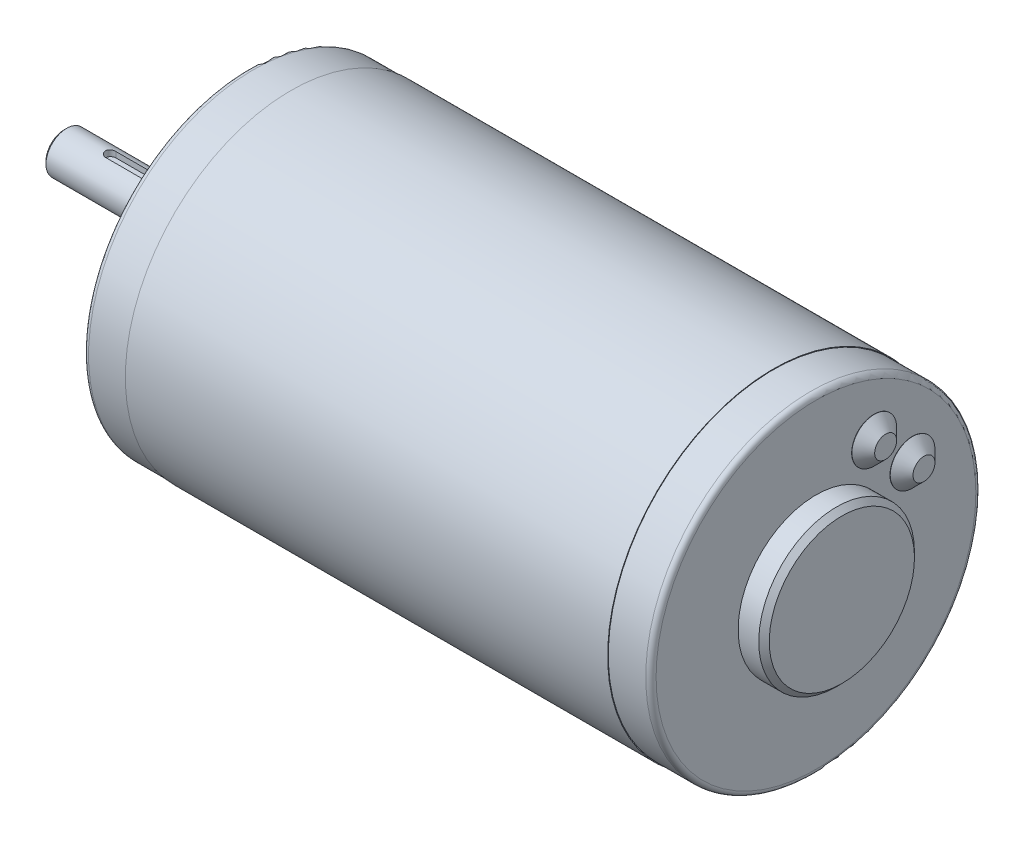
ISO-10303-21;
HEADER;
FILE_DESCRIPTION(('STEP AP214'),'2;1');
FILE_NAME('part.step','',(''),(''),'','','');
FILE_SCHEMA(('AUTOMOTIVE_DESIGN { 1 0 10303 214 1 1 1 1 }'));
ENDSEC;
DATA;
#1=APPLICATION_CONTEXT('core data for automotive mechanical design processes');
#2=APPLICATION_PROTOCOL_DEFINITION('international standard','automotive_design',2000,#1);
#3=PRODUCT_CONTEXT('',#1,'mechanical');
#4=PRODUCT('Part','Part','',(#3));
#5=PRODUCT_RELATED_PRODUCT_CATEGORY('part','',(#4));
#6=PRODUCT_DEFINITION_FORMATION('','',#4);
#7=PRODUCT_DEFINITION_CONTEXT('part definition',#1,'design');
#8=PRODUCT_DEFINITION('design','',#6,#7);
#9=PRODUCT_DEFINITION_SHAPE('','',#8);
#10=(LENGTH_UNIT() NAMED_UNIT(*) SI_UNIT(.MILLI.,.METRE.));
#11=(NAMED_UNIT(*) PLANE_ANGLE_UNIT() SI_UNIT($,.RADIAN.));
#12=(NAMED_UNIT(*) SI_UNIT($,.STERADIAN.) SOLID_ANGLE_UNIT());
#13=UNCERTAINTY_MEASURE_WITH_UNIT(LENGTH_MEASURE(1.E-05),#10,'distance_accuracy_value','');
#14=(GEOMETRIC_REPRESENTATION_CONTEXT(3) GLOBAL_UNCERTAINTY_ASSIGNED_CONTEXT((#13)) GLOBAL_UNIT_ASSIGNED_CONTEXT((#10,
#11,#12)) REPRESENTATION_CONTEXT('',''));
#15=CARTESIAN_POINT('',(0.,0.,0.));
#16=DIRECTION('',(0.,0.,1.));
#17=DIRECTION('',(1.,0.,0.));
#18=AXIS2_PLACEMENT_3D('',#15,#16,#17);
#19=CARTESIAN_POINT('',(-27.6,2.79999999999999,-1.));
#20=DIRECTION('',(0.,-1.,0.));
#21=DIRECTION('',(0.,0.,-1.));
#22=AXIS2_PLACEMENT_3D('',#19,#20,#21);
#23=PLANE('',#22);
#24=CARTESIAN_POINT('',(-7.1,2.79999999999999,0.));
#25=DIRECTION('',(0.,1.,0.));
#26=DIRECTION('',(0.,0.,1.));
#27=AXIS2_PLACEMENT_3D('',#24,#25,#26);
#28=CIRCLE('',#27,1.);
#29=CARTESIAN_POINT('',(-7.1,2.79999999999999,1.));
#30=VERTEX_POINT('',#29);
#31=CARTESIAN_POINT('',(-7.1,2.79999999999999,-1.));
#32=VERTEX_POINT('',#31);
#33=EDGE_CURVE('E79',#30,#32,#28,.T.);
#34=ORIENTED_EDGE('',*,*,#33,.T.);
#35=DIRECTION('',(1.,0.,0.));
#36=VECTOR('',#35,1.);
#37=CARTESIAN_POINT('',(-27.6,2.79999999999999,-1.));
#38=LINE('',#37,#36);
#39=CARTESIAN_POINT('',(-26.6,2.79999999999999,-1.));
#40=VERTEX_POINT('',#39);
#41=EDGE_CURVE('E74',#40,#32,#38,.T.);
#42=ORIENTED_EDGE('',*,*,#41,.F.);
#43=CARTESIAN_POINT('',(-26.6,2.79999999999999,0.));
#44=DIRECTION('',(0.,-1.,0.));
#45=DIRECTION('',(0.,0.,-1.));
#46=AXIS2_PLACEMENT_3D('',#43,#44,#45);
#47=CIRCLE('',#46,1.);
#48=CARTESIAN_POINT('',(-26.6,2.79999999999999,1.));
#49=VERTEX_POINT('',#48);
#50=EDGE_CURVE('E76',#40,#49,#47,.F.);
#51=ORIENTED_EDGE('',*,*,#50,.T.);
#52=DIRECTION('',(1.,0.,0.));
#53=VECTOR('',#52,1.);
#54=CARTESIAN_POINT('',(-27.6,2.79999999999999,1.));
#55=LINE('',#54,#53);
#56=EDGE_CURVE('E102',#49,#30,#55,.T.);
#57=ORIENTED_EDGE('',*,*,#56,.T.);
#58=EDGE_LOOP('',(#34,#42,#51,#57));
#59=FACE_BOUND('',#58,.T.);
#60=ADVANCED_FACE('F16',(#59),#23,.F.);
#61=CARTESIAN_POINT('',(-35.6,0.,0.));
#62=DIRECTION('',(-1.,0.,0.));
#63=DIRECTION('',(0.,0.,1.));
#64=AXIS2_PLACEMENT_3D('',#61,#62,#63);
#65=PLANE('',#64);
#66=CARTESIAN_POINT('',(-35.6000000000449,0.,0.));
#67=DIRECTION('',(1.,0.,0.));
#68=DIRECTION('',(0.,0.,-1.));
#69=AXIS2_PLACEMENT_3D('',#66,#67,#68);
#70=CIRCLE('',#69,3.49999999997408);
#71=CARTESIAN_POINT('',(-35.6000000000449,0.,-3.49999999997408));
#72=VERTEX_POINT('',#71);
#73=EDGE_CURVE('E324',#72,#72,#70,.T.);
#74=ORIENTED_EDGE('',*,*,#73,.F.);
#75=EDGE_LOOP('',(#74));
#76=FACE_BOUND('',#75,.T.);
#77=ADVANCED_FACE('F663',(#76),#65,.T.);
#78=CARTESIAN_POINT('',(-26.6,3.87298334620741,0.));
#79=DIRECTION('',(0.,-1.,0.));
#80=DIRECTION('',(0.,0.,-1.));
#81=AXIS2_PLACEMENT_3D('',#78,#79,#80);
#82=CYLINDRICAL_SURFACE('',#81,1.);
#83=CARTESIAN_POINT('',(-26.6,3.87298334620741,1.));
#84=CARTESIAN_POINT('',(-26.6276629851065,3.87298148580177,1.00000033749611));
#85=CARTESIAN_POINT('',(-26.6553122630182,3.8732800994947,0.998851407375366));
#86=CARTESIAN_POINT('',(-26.7104040353036,3.87445904774558,0.994271295395754));
#87=CARTESIAN_POINT('',(-26.7378465636871,3.87533928441687,0.99084049757268));
#88=CARTESIAN_POINT('',(-26.8194531732088,3.87881710972053,0.977175239382527));
#89=CARTESIAN_POINT('',(-26.8730564684822,3.88225203148808,0.963567695172493));
#90=CARTESIAN_POINT('',(-26.977124673782,3.89095422588002,0.927798076247996));
#91=CARTESIAN_POINT('',(-27.0275898782129,3.89622132630929,0.905636805423835));
#92=CARTESIAN_POINT('',(-27.1241114486473,3.90799134471939,0.853415378025865));
#93=CARTESIAN_POINT('',(-27.170166627891,3.91449459395647,0.823353103356933));
#94=CARTESIAN_POINT('',(-27.2575438819061,3.92816262398025,0.755484471828068));
#95=CARTESIAN_POINT('',(-27.2987548862455,3.93533791028915,0.717537268783974));
#96=CARTESIAN_POINT('',(-27.3743020894827,3.94945104396193,0.635275780516228));
#97=CARTESIAN_POINT('',(-27.4086371894679,3.95638885322537,0.590960479478829));
#98=CARTESIAN_POINT('',(-27.4699110016186,3.96936182283248,0.496456899401689));
#99=CARTESIAN_POINT('',(-27.496739895984,3.9753830468173,0.446195340334472));
#100=CARTESIAN_POINT('',(-27.5415247341967,3.98572346250588,0.341702590842916));
#101=CARTESIAN_POINT('',(-27.5594824242998,3.990042989147,0.287472184083007));
#102=CARTESIAN_POINT('',(-27.5856589927774,3.99641900005128,0.177744108525158));
#103=CARTESIAN_POINT('',(-27.5940676724228,3.998519529013,0.122294322002856));
#104=CARTESIAN_POINT('',(-27.6015033715433,4.00037438150815,0.0107327756816783));
#105=CARTESIAN_POINT('',(-27.6005315701923,4.00012899993444,-0.0453789000287066));
#106=CARTESIAN_POINT('',(-27.5893700363145,3.99735237365735,-0.155352492972097));
#107=CARTESIAN_POINT('',(-27.5793853834005,3.9948719867736,-0.209236701739855));
#108=CARTESIAN_POINT('',(-27.5508113208172,3.98796330636495,-0.31453871108434));
#109=CARTESIAN_POINT('',(-27.5322215304314,3.98353492665556,-0.365956402423988));
#110=CARTESIAN_POINT('',(-27.4867987193293,3.97314997761798,-0.46540728602454));
#111=CARTESIAN_POINT('',(-27.4598926057672,3.96717993827555,-0.513405629602248));
#112=CARTESIAN_POINT('',(-27.3986568701665,3.95435945541919,-0.604276631230015));
#113=CARTESIAN_POINT('',(-27.3643261297468,3.94750887933198,-0.64714851556229));
#114=CARTESIAN_POINT('',(-27.2881210879187,3.93345566022865,-0.727769389708492));
#115=CARTESIAN_POINT('',(-27.2460683634602,3.92624850477685,-0.765349103054128));
#116=CARTESIAN_POINT('',(-27.1561701330723,3.91246168284006,-0.832969575186237));
#117=CARTESIAN_POINT('',(-27.1083230467164,3.90588218842993,-0.863008270245062));
#118=CARTESIAN_POINT('',(-27.0078544021762,3.89407813586325,-0.914804709285962));
#119=CARTESIAN_POINT('',(-26.9552085351039,3.88886106009136,-0.936517017887269));
#120=CARTESIAN_POINT('',(-26.8468830715817,3.88047058807055,-0.970702351849828));
#121=CARTESIAN_POINT('',(-26.7912081448502,3.87729413761435,-0.983189189212132));
#122=CARTESIAN_POINT('',(-26.7125426192411,3.87455290681524,-0.993904635150938));
#123=CARTESIAN_POINT('',(-26.6900802967868,3.87396523110859,-0.996190790966708));
#124=CARTESIAN_POINT('',(-26.6450822100907,3.87318062488974,-0.999236757697394));
#125=CARTESIAN_POINT('',(-26.6225466240447,3.87298306219461,-0.999999038096045));
#126=CARTESIAN_POINT('',(-26.6,3.87298334620741,-1.));
#127=B_SPLINE_CURVE_WITH_KNOTS('',3,(#83,#84,#85,#86,#87,#88,#89,#90,#91,#92,#93,#94,#95,#96,
#97,#98,#99,#100,#101,#102,#103,#104,#105,#106,#107,#108,#109,#110,#111,#112,#113,#114,#115,
#116,#117,#118,#119,#120,#121,#122,#123,#124,#125,#126),.UNSPECIFIED.,.F.,.F.,(4,2,2,2,2,2,2,2,
2,2,2,2,2,2,2,2,2,2,2,2,2,4),(0.,0.0829365303397693,0.16585910608465,0.331229963080318,
0.496585282091499,0.661984974726751,0.830641897427977,0.999325753539196,1.17036187098235,
1.34136430732425,1.50890481515325,1.67642426256639,1.84022545479276,2.00403389475838,
2.16932509450376,2.33464120964329,2.50441429534542,2.67423379180967,2.84496720161068,
3.01544447539986,3.08315848722648,3.15076267731671),.UNSPECIFIED.);
#128=CARTESIAN_POINT('',(-26.6,3.87298334620741,1.));
#129=VERTEX_POINT('',#128);
#130=CARTESIAN_POINT('',(-26.6,3.87298334620741,-1.));
#131=VERTEX_POINT('',#130);
#132=EDGE_CURVE('E160',#129,#131,#127,.T.);
#133=ORIENTED_EDGE('',*,*,#132,.F.);
#134=DIRECTION('',(0.,1.,0.));
#135=VECTOR('',#134,1.);
#136=CARTESIAN_POINT('',(-26.6,2.79999999999999,1.));
#137=LINE('',#136,#135);
#138=EDGE_CURVE('E89',#129,#49,#137,.F.);
#139=ORIENTED_EDGE('',*,*,#138,.T.);
#140=ORIENTED_EDGE('',*,*,#50,.F.);
#141=DIRECTION('',(0.,1.,0.));
#142=VECTOR('',#141,1.);
#143=CARTESIAN_POINT('',(-26.6,2.79999999999999,-1.));
#144=LINE('',#143,#142);
#145=EDGE_CURVE('E83',#131,#40,#144,.F.);
#146=ORIENTED_EDGE('',*,*,#145,.F.);
#147=EDGE_LOOP('',(#133,#139,#140,#146));
#148=FACE_BOUND('',#147,.T.);
#149=ADVANCED_FACE('F86',(#148),#82,.F.);
#150=CARTESIAN_POINT('',(-27.6,2.79999999999999,-1.));
#151=DIRECTION('',(0.,0.,1.));
#152=DIRECTION('',(1.,0.,0.));
#153=AXIS2_PLACEMENT_3D('',#150,#151,#152);
#154=PLANE('',#153);
#155=DIRECTION('',(1.,0.,0.));
#156=VECTOR('',#155,1.);
#157=CARTESIAN_POINT('',(0.,3.87298334620741,-1.));
#158=LINE('',#157,#156);
#159=CARTESIAN_POINT('',(-7.1,3.87298334620741,-1.));
#160=VERTEX_POINT('',#159);
#161=EDGE_CURVE('E94',#131,#160,#158,.T.);
#162=ORIENTED_EDGE('',*,*,#161,.F.);
#163=ORIENTED_EDGE('',*,*,#145,.T.);
#164=ORIENTED_EDGE('',*,*,#41,.T.);
#165=DIRECTION('',(0.,1.,0.));
#166=VECTOR('',#165,1.);
#167=CARTESIAN_POINT('',(-7.1,2.79999999999999,-1.));
#168=LINE('',#167,#166);
#169=EDGE_CURVE('E97',#32,#160,#168,.T.);
#170=ORIENTED_EDGE('',*,*,#169,.T.);
#171=EDGE_LOOP('',(#162,#163,#164,#170));
#172=FACE_BOUND('',#171,.T.);
#173=ADVANCED_FACE('F92',(#172),#154,.T.);
#174=CARTESIAN_POINT('',(-7.1,2.79999999999999,0.));
#175=DIRECTION('',(0.,1.,0.));
#176=DIRECTION('',(0.,0.,1.));
#177=AXIS2_PLACEMENT_3D('',#174,#175,#176);
#178=CYLINDRICAL_SURFACE('',#177,1.);
#179=ORIENTED_EDGE('',*,*,#33,.F.);
#180=DIRECTION('',(0.,1.,0.));
#181=VECTOR('',#180,1.);
#182=CARTESIAN_POINT('',(-7.1,2.79999999999999,1.));
#183=LINE('',#182,#181);
#184=CARTESIAN_POINT('',(-7.1,3.87298334620741,1.));
#185=VERTEX_POINT('',#184);
#186=EDGE_CURVE('E103',#30,#185,#183,.T.);
#187=ORIENTED_EDGE('',*,*,#186,.T.);
#188=CARTESIAN_POINT('',(-7.1,3.87298334620741,-1.));
#189=CARTESIAN_POINT('',(-7.07233701489346,3.87298148580177,-1.00000033749611));
#190=CARTESIAN_POINT('',(-7.04468773698177,3.8732800994947,-0.998851407375366));
#191=CARTESIAN_POINT('',(-6.98959596469644,3.87445904774558,-0.994271295395754));
#192=CARTESIAN_POINT('',(-6.96215343631291,3.87533928441687,-0.990840497572679));
#193=CARTESIAN_POINT('',(-6.88054682679116,3.87881710972053,-0.977175239382527));
#194=CARTESIAN_POINT('',(-6.82694353151779,3.88225203148808,-0.963567695172494));
#195=CARTESIAN_POINT('',(-6.72287532621804,3.89095422588002,-0.927798076247997));
#196=CARTESIAN_POINT('',(-6.67241012178715,3.89622132630929,-0.905636805423836));
#197=CARTESIAN_POINT('',(-6.57588855135267,3.90799134471939,-0.853415378025865));
#198=CARTESIAN_POINT('',(-6.52983337210904,3.91449459395647,-0.823353103356933));
#199=CARTESIAN_POINT('',(-6.4424561180939,3.92816262398025,-0.755484471828069));
#200=CARTESIAN_POINT('',(-6.40124511375448,3.93533791028915,-0.717537268783976));
#201=CARTESIAN_POINT('',(-6.3256979105173,3.94945104396193,-0.63527578051623));
#202=CARTESIAN_POINT('',(-6.29136281053206,3.95638885322537,-0.590960479478831));
#203=CARTESIAN_POINT('',(-6.23008899838136,3.96936182283248,-0.496456899401691));
#204=CARTESIAN_POINT('',(-6.20326010401603,3.9753830468173,-0.446195340334474));
#205=CARTESIAN_POINT('',(-6.1584752658033,3.98572346250588,-0.341702590842919));
#206=CARTESIAN_POINT('',(-6.14051757570017,3.990042989147,-0.28747218408301));
#207=CARTESIAN_POINT('',(-6.11434100722257,3.99641900005128,-0.17774410852516));
#208=CARTESIAN_POINT('',(-6.10593232757718,3.998519529013,-0.122294322002858));
#209=CARTESIAN_POINT('',(-6.09849662845671,4.00037438150815,-0.0107327756816796));
#210=CARTESIAN_POINT('',(-6.09946842980766,4.00012899993444,0.0453789000287056));
#211=CARTESIAN_POINT('',(-6.11062996368545,3.99735237365735,0.155352492972096));
#212=CARTESIAN_POINT('',(-6.12061461659948,3.9948719867736,0.209236701739855));
#213=CARTESIAN_POINT('',(-6.14918867918275,3.98796330636495,0.31453871108434));
#214=CARTESIAN_POINT('',(-6.16777846956858,3.98353492665556,0.365956402423988));
#215=CARTESIAN_POINT('',(-6.21320128067065,3.97314997761798,0.465407286024539));
#216=CARTESIAN_POINT('',(-6.24010739423284,3.96717993827555,0.513405629602249));
#217=CARTESIAN_POINT('',(-6.30134312983347,3.95435945541919,0.604276631230014));
#218=CARTESIAN_POINT('',(-6.33567387025322,3.94750887933198,0.647148515562289));
#219=CARTESIAN_POINT('',(-6.41187891208131,3.93345566022865,0.72776938970849));
#220=CARTESIAN_POINT('',(-6.45393163653982,3.92624850477685,0.765349103054127));
#221=CARTESIAN_POINT('',(-6.54382986692774,3.91246168284006,0.832969575186237));
#222=CARTESIAN_POINT('',(-6.59167695328356,3.90588218842993,0.863008270245062));
#223=CARTESIAN_POINT('',(-6.69214559782377,3.89407813586325,0.914804709285962));
#224=CARTESIAN_POINT('',(-6.74479146489609,3.88886106009136,0.936517017887269));
#225=CARTESIAN_POINT('',(-6.85311692841829,3.88047058807055,0.970702351849828));
#226=CARTESIAN_POINT('',(-6.90879185514984,3.87729413761435,0.983189189212131));
#227=CARTESIAN_POINT('',(-6.98745738075891,3.87455290681524,0.993904635150938));
#228=CARTESIAN_POINT('',(-7.00991970321318,3.87396523110859,0.996190790966708));
#229=CARTESIAN_POINT('',(-7.05491778990932,3.87318062488974,0.999236757697394));
#230=CARTESIAN_POINT('',(-7.07745337595529,3.8729830621946,0.999999038096045));
#231=CARTESIAN_POINT('',(-7.1,3.87298334620741,1.));
#232=B_SPLINE_CURVE_WITH_KNOTS('',3,(#188,#189,#190,#191,#192,#193,#194,#195,#196,#197,#198,
#199,#200,#201,#202,#203,#204,#205,#206,#207,#208,#209,#210,#211,#212,#213,#214,#215,#216,#217,
#218,#219,#220,#221,#222,#223,#224,#225,#226,#227,#228,#229,#230,#231),.UNSPECIFIED.,.F.,.F.,(4,
2,2,2,2,2,2,2,2,2,2,2,2,2,2,2,2,2,2,2,2,4),(0.,0.0829365303397684,0.165859106084651,
0.331229963080317,0.496585282091498,0.661984974726749,0.830641897427974,0.999325753539193,
1.17036187098235,1.34136430732424,1.50890481515325,1.67642426256639,1.84022545479276,
2.00403389475838,2.16932509450376,2.33464120964329,2.50441429534542,2.67423379180967,
2.84496720161068,3.01544447539986,3.08315848722648,3.15076267731671),.UNSPECIFIED.);
#233=EDGE_CURVE('E151',#160,#185,#232,.T.);
#234=ORIENTED_EDGE('',*,*,#233,.F.);
#235=ORIENTED_EDGE('',*,*,#169,.F.);
#236=EDGE_LOOP('',(#179,#187,#234,#235));
#237=FACE_BOUND('',#236,.T.);
#238=ADVANCED_FACE('F166',(#237),#178,.F.);
#239=CARTESIAN_POINT('',(-27.6,2.79999999999999,1.));
#240=DIRECTION('',(0.,0.,1.));
#241=DIRECTION('',(1.,0.,0.));
#242=AXIS2_PLACEMENT_3D('',#239,#240,#241);
#243=PLANE('',#242);
#244=ORIENTED_EDGE('',*,*,#186,.F.);
#245=ORIENTED_EDGE('',*,*,#56,.F.);
#246=ORIENTED_EDGE('',*,*,#138,.F.);
#247=DIRECTION('',(1.,0.,0.));
#248=VECTOR('',#247,1.);
#249=CARTESIAN_POINT('',(0.,3.87298334620741,1.));
#250=LINE('',#249,#248);
#251=EDGE_CURVE('E159',#185,#129,#250,.F.);
#252=ORIENTED_EDGE('',*,*,#251,.F.);
#253=EDGE_LOOP('',(#244,#245,#246,#252));
#254=FACE_BOUND('',#253,.T.);
#255=ADVANCED_FACE('F181',(#254),#243,.F.);
#256=CARTESIAN_POINT('',(-35.0999999999999,0.,0.));
#257=DIRECTION('',(1.,0.,0.));
#258=DIRECTION('',(0.,0.,-1.));
#259=AXIS2_PLACEMENT_3D('',#256,#257,#258);
#260=CONICAL_SURFACE('',#259,3.99999999996226,0.785398163340605);
#261=ORIENTED_EDGE('',*,*,#73,.T.);
#262=EDGE_LOOP('',(#261));
#263=FACE_BOUND('',#262,.T.);
#264=CARTESIAN_POINT('',(-35.1,0.,0.));
#265=DIRECTION('',(1.,0.,0.));
#266=DIRECTION('',(0.,0.,-1.));
#267=AXIS2_PLACEMENT_3D('',#264,#265,#266);
#268=CIRCLE('',#267,4.);
#269=CARTESIAN_POINT('',(-35.1,0.,-4.));
#270=VERTEX_POINT('',#269);
#271=EDGE_CURVE('E150',#270,#270,#268,.T.);
#272=ORIENTED_EDGE('',*,*,#271,.F.);
#273=EDGE_LOOP('',(#272));
#274=FACE_BOUND('',#273,.T.);
#275=ADVANCED_FACE('F176',(#263,#274),#260,.T.);
#276=CARTESIAN_POINT('',(0.,0.,0.));
#277=DIRECTION('',(1.,0.,0.));
#278=DIRECTION('',(0.,0.,-1.));
#279=AXIS2_PLACEMENT_3D('',#276,#277,#278);
#280=CYLINDRICAL_SURFACE('',#279,4.);
#281=ORIENTED_EDGE('',*,*,#271,.T.);
#282=EDGE_LOOP('',(#281));
#283=FACE_BOUND('',#282,.T.);
#284=CARTESIAN_POINT('',(-4.,0.,0.));
#285=DIRECTION('',(1.,0.,0.));
#286=DIRECTION('',(0.,0.,-1.));
#287=AXIS2_PLACEMENT_3D('',#284,#285,#286);
#288=CIRCLE('',#287,4.);
#289=CARTESIAN_POINT('',(-4.,0.,-4.));
#290=VERTEX_POINT('',#289);
#291=EDGE_CURVE('E147',#290,#290,#288,.T.);
#292=ORIENTED_EDGE('',*,*,#291,.F.);
#293=EDGE_LOOP('',(#292));
#294=FACE_BOUND('',#293,.T.);
#295=ORIENTED_EDGE('',*,*,#233,.T.);
#296=ORIENTED_EDGE('',*,*,#251,.T.);
#297=ORIENTED_EDGE('',*,*,#132,.T.);
#298=ORIENTED_EDGE('',*,*,#161,.T.);
#299=EDGE_LOOP('',(#295,#296,#297,#298));
#300=FACE_BOUND('',#299,.T.);
#301=ADVANCED_FACE('F170',(#283,#294,#300),#280,.T.);
#302=CARTESIAN_POINT('',(-4.,4.,0.));
#303=DIRECTION('',(-1.,0.,0.));
#304=DIRECTION('',(0.,0.,1.));
#305=AXIS2_PLACEMENT_3D('',#302,#303,#304);
#306=PLANE('',#305);
#307=ORIENTED_EDGE('',*,*,#291,.T.);
#308=EDGE_LOOP('',(#307));
#309=FACE_BOUND('',#308,.T.);
#310=CARTESIAN_POINT('',(-4.,0.,0.));
#311=DIRECTION('',(1.,0.,0.));
#312=DIRECTION('',(0.,1.,0.));
#313=AXIS2_PLACEMENT_3D('',#310,#311,#312);
#314=CIRCLE('',#313,8.509);
#315=CARTESIAN_POINT('',(-4.,8.509,0.));
#316=VERTEX_POINT('',#315);
#317=EDGE_CURVE('E144',#316,#316,#314,.T.);
#318=ORIENTED_EDGE('',*,*,#317,.F.);
#319=EDGE_LOOP('',(#318));
#320=FACE_BOUND('',#319,.T.);
#321=ADVANCED_FACE('F175',(#309,#320),#306,.T.);
#322=CARTESIAN_POINT('',(111.8479,18.6070906828553,-11.2073596390943));
#323=DIRECTION('',(1.,0.,0.));
#324=DIRECTION('',(0.,0.,-1.));
#325=AXIS2_PLACEMENT_3D('',#322,#323,#324);
#326=PLANE('',#325);
#327=CARTESIAN_POINT('',(111.84789999993,18.6070906828553,-11.2073596390943));
#328=DIRECTION('',(-1.,0.,0.));
#329=DIRECTION('',(0.,-1.,0.));
#330=AXIS2_PLACEMENT_3D('',#327,#328,#329);
#331=CIRCLE('',#330,2.11800000003146);
#332=CARTESIAN_POINT('',(111.84789999993,16.4890906828238,-11.2073596390943));
#333=VERTEX_POINT('',#332);
#334=EDGE_CURVE('E141',#333,#333,#331,.T.);
#335=ORIENTED_EDGE('',*,*,#334,.F.);
#336=EDGE_LOOP('',(#335));
#337=FACE_BOUND('',#336,.T.);
#338=ADVANCED_FACE('F465',(#337),#326,.T.);
#339=CARTESIAN_POINT('',(114.6,15.0368,0.));
#340=DIRECTION('',(1.,0.,0.));
#341=DIRECTION('',(0.,0.,-1.));
#342=AXIS2_PLACEMENT_3D('',#339,#340,#341);
#343=PLANE('',#342);
#344=CARTESIAN_POINT('',(114.6,0.,0.));
#345=DIRECTION('',(-1.,0.,0.));
#346=DIRECTION('',(0.,-1.,0.));
#347=AXIS2_PLACEMENT_3D('',#344,#345,#346);
#348=CIRCLE('',#347,14.0208);
#349=CARTESIAN_POINT('',(114.6,-14.0208,0.));
#350=VERTEX_POINT('',#349);
#351=EDGE_CURVE('E138',#350,#350,#348,.T.);
#352=ORIENTED_EDGE('',*,*,#351,.F.);
#353=EDGE_LOOP('',(#352));
#354=FACE_BOUND('',#353,.T.);
#355=ADVANCED_FACE('F455',(#354),#343,.T.);
#356=CARTESIAN_POINT('',(111.8479,11.2073596390943,-18.6070906828553));
#357=DIRECTION('',(1.,0.,0.));
#358=DIRECTION('',(0.,0.,-1.));
#359=AXIS2_PLACEMENT_3D('',#356,#357,#358);
#360=PLANE('',#359);
#361=CARTESIAN_POINT('',(111.84789999993,11.2073596390943,-18.6070906828553));
#362=DIRECTION('',(-1.,0.,0.));
#363=DIRECTION('',(0.,0.,1.));
#364=AXIS2_PLACEMENT_3D('',#361,#362,#363);
#365=CIRCLE('',#364,2.1180000000021);
#366=CARTESIAN_POINT('',(111.84789999993,11.2073596390943,-16.4890906828532));
#367=VERTEX_POINT('',#366);
#368=EDGE_CURVE('E134',#367,#367,#365,.T.);
#369=ORIENTED_EDGE('',*,*,#368,.F.);
#370=EDGE_LOOP('',(#369));
#371=FACE_BOUND('',#370,.T.);
#372=ADVANCED_FACE('F448',(#371),#360,.T.);
#373=CARTESIAN_POINT('',(13.6143999999945,25.4,0.));
#374=DIRECTION('',(-1.,0.,0.));
#375=DIRECTION('',(0.,0.,1.));
#376=AXIS2_PLACEMENT_3D('',#373,#374,#375);
#377=CONICAL_SURFACE('',#376,2.01929999997219,1.02974425867198);
#378=CARTESIAN_POINT('',(14.827717847993,25.4,0.));
#379=VERTEX_POINT('',#378);
#380=VERTEX_LOOP('',#379);
#381=FACE_BOUND('',#380,.T.);
#382=CARTESIAN_POINT('',(13.6144,25.4,0.));
#383=DIRECTION('',(-1.,0.,0.));
#384=DIRECTION('',(0.,0.,1.));
#385=AXIS2_PLACEMENT_3D('',#382,#383,#384);
#386=CIRCLE('',#385,2.0193);
#387=CARTESIAN_POINT('',(13.6144,25.4,2.0193));
#388=VERTEX_POINT('',#387);
#389=EDGE_CURVE('E137',#388,#388,#386,.T.);
#390=ORIENTED_EDGE('',*,*,#389,.T.);
#391=EDGE_LOOP('',(#390));
#392=FACE_BOUND('',#391,.T.);
#393=ADVANCED_FACE('F454',(#381,#392),#377,.F.);
#394=CARTESIAN_POINT('',(13.6143999999945,-25.4,0.));
#395=DIRECTION('',(-1.,0.,0.));
#396=DIRECTION('',(0.,0.,1.));
#397=AXIS2_PLACEMENT_3D('',#394,#395,#396);
#398=CONICAL_SURFACE('',#397,2.01929999997219,1.02974425867198);
#399=CARTESIAN_POINT('',(14.827717847993,-25.4,0.));
#400=VERTEX_POINT('',#399);
#401=VERTEX_LOOP('',#400);
#402=FACE_BOUND('',#401,.T.);
#403=CARTESIAN_POINT('',(13.6144,-25.4,0.));
#404=DIRECTION('',(-1.,0.,0.));
#405=DIRECTION('',(0.,0.,1.));
#406=AXIS2_PLACEMENT_3D('',#403,#404,#405);
#407=CIRCLE('',#406,2.0193);
#408=CARTESIAN_POINT('',(13.6144,-25.4,2.0193));
#409=VERTEX_POINT('',#408);
#410=EDGE_CURVE('E314',#409,#409,#407,.T.);
#411=ORIENTED_EDGE('',*,*,#410,.T.);
#412=EDGE_LOOP('',(#411));
#413=FACE_BOUND('',#412,.T.);
#414=ADVANCED_FACE('F516',(#402,#413),#398,.F.);
#415=CARTESIAN_POINT('',(-2.984,0.,0.));
#416=DIRECTION('',(1.,0.,0.));
#417=DIRECTION('',(0.,1.,0.));
#418=AXIS2_PLACEMENT_3D('',#415,#416,#417);
#419=CONICAL_SURFACE('',#418,9.525,0.78539816339745);
#420=ORIENTED_EDGE('',*,*,#317,.T.);
#421=EDGE_LOOP('',(#420));
#422=FACE_BOUND('',#421,.T.);
#423=CARTESIAN_POINT('',(-2.984,0.,0.));
#424=DIRECTION('',(1.,0.,0.));
#425=DIRECTION('',(0.,0.,-1.));
#426=AXIS2_PLACEMENT_3D('',#423,#424,#425);
#427=CIRCLE('',#426,9.525);
#428=CARTESIAN_POINT('',(-2.984,0.,-9.525));
#429=VERTEX_POINT('',#428);
#430=EDGE_CURVE('E311',#429,#429,#427,.T.);
#431=ORIENTED_EDGE('',*,*,#430,.F.);
#432=EDGE_LOOP('',(#431));
#433=FACE_BOUND('',#432,.T.);
#434=ADVANCED_FACE('F440',(#422,#433),#419,.T.);
#435=CARTESIAN_POINT('',(109.647900000027,18.6070906828553,-11.2073596390943));
#436=DIRECTION('',(-1.,0.,0.));
#437=DIRECTION('',(0.,-1.,0.));
#438=AXIS2_PLACEMENT_3D('',#435,#436,#437);
#439=CONICAL_SURFACE('',#438,4.31799999987712,0.785398163384529);
#440=CARTESIAN_POINT('',(109.6479,18.6070906828553,-11.2073596390943));
#441=DIRECTION('',(-1.,0.,0.));
#442=DIRECTION('',(0.,0.,1.));
#443=AXIS2_PLACEMENT_3D('',#440,#441,#442);
#444=CIRCLE('',#443,4.318);
#445=CARTESIAN_POINT('',(109.6479,18.6070906828553,-6.88935963909434));
#446=VERTEX_POINT('',#445);
#447=EDGE_CURVE('E308',#446,#446,#444,.T.);
#448=ORIENTED_EDGE('',*,*,#447,.F.);
#449=EDGE_LOOP('',(#448));
#450=FACE_BOUND('',#449,.T.);
#451=ORIENTED_EDGE('',*,*,#334,.T.);
#452=EDGE_LOOP('',(#451));
#453=FACE_BOUND('',#452,.T.);
#454=ADVANCED_FACE('F434',(#450,#453),#439,.T.);
#455=CARTESIAN_POINT('',(113.584,0.,0.));
#456=DIRECTION('',(-1.,0.,0.));
#457=DIRECTION('',(0.,-1.,0.));
#458=AXIS2_PLACEMENT_3D('',#455,#456,#457);
#459=CONICAL_SURFACE('',#458,15.0368,0.785398163397441);
#460=ORIENTED_EDGE('',*,*,#351,.T.);
#461=EDGE_LOOP('',(#460));
#462=FACE_BOUND('',#461,.T.);
#463=CARTESIAN_POINT('',(113.584,0.,0.));
#464=DIRECTION('',(1.,0.,0.));
#465=DIRECTION('',(0.,0.,-1.));
#466=AXIS2_PLACEMENT_3D('',#463,#464,#465);
#467=CIRCLE('',#466,15.0368);
#468=CARTESIAN_POINT('',(113.584,0.,-15.0368));
#469=VERTEX_POINT('',#468);
#470=EDGE_CURVE('E305',#469,#469,#467,.F.);
#471=ORIENTED_EDGE('',*,*,#470,.F.);
#472=EDGE_LOOP('',(#471));
#473=FACE_BOUND('',#472,.T.);
#474=ADVANCED_FACE('F424',(#462,#473),#459,.T.);
#475=CARTESIAN_POINT('',(109.647900000084,11.2073596390943,-18.6070906828553));
#476=DIRECTION('',(-1.,0.,0.));
#477=DIRECTION('',(0.,0.,1.));
#478=AXIS2_PLACEMENT_3D('',#475,#476,#477);
#479=CONICAL_SURFACE('',#478,4.31799999990461,0.785398163410367);
#480=CARTESIAN_POINT('',(109.6479,11.2073596390943,-18.6070906828553));
#481=DIRECTION('',(-1.,0.,0.));
#482=DIRECTION('',(0.,0.,1.));
#483=AXIS2_PLACEMENT_3D('',#480,#481,#482);
#484=CIRCLE('',#483,4.318);
#485=CARTESIAN_POINT('',(109.6479,11.2073596390943,-14.2890906828553));
#486=VERTEX_POINT('',#485);
#487=EDGE_CURVE('E133',#486,#486,#484,.T.);
#488=ORIENTED_EDGE('',*,*,#487,.F.);
#489=EDGE_LOOP('',(#488));
#490=FACE_BOUND('',#489,.T.);
#491=ORIENTED_EDGE('',*,*,#368,.T.);
#492=EDGE_LOOP('',(#491));
#493=FACE_BOUND('',#492,.T.);
#494=ADVANCED_FACE('F417',(#490,#493),#479,.T.);
#495=CARTESIAN_POINT('',(0.,25.4,0.));
#496=DIRECTION('',(-1.,0.,0.));
#497=DIRECTION('',(0.,0.,1.));
#498=AXIS2_PLACEMENT_3D('',#495,#496,#497);
#499=CYLINDRICAL_SURFACE('',#498,2.0193);
#500=CARTESIAN_POINT('',(0.,25.4,0.));
#501=DIRECTION('',(-1.,0.,0.));
#502=DIRECTION('',(0.,0.,1.));
#503=AXIS2_PLACEMENT_3D('',#500,#501,#502);
#504=CIRCLE('',#503,2.0193);
#505=CARTESIAN_POINT('',(0.,25.4,2.0193));
#506=VERTEX_POINT('',#505);
#507=EDGE_CURVE('E130',#506,#506,#504,.F.);
#508=ORIENTED_EDGE('',*,*,#507,.F.);
#509=EDGE_LOOP('',(#508));
#510=FACE_BOUND('',#509,.T.);
#511=ORIENTED_EDGE('',*,*,#389,.F.);
#512=EDGE_LOOP('',(#511));
#513=FACE_BOUND('',#512,.T.);
#514=ADVANCED_FACE('F423',(#510,#513),#499,.F.);
#515=CARTESIAN_POINT('',(0.,-25.4,0.));
#516=DIRECTION('',(-1.,0.,0.));
#517=DIRECTION('',(0.,0.,1.));
#518=AXIS2_PLACEMENT_3D('',#515,#516,#517);
#519=CYLINDRICAL_SURFACE('',#518,2.0193);
#520=CARTESIAN_POINT('',(0.,-25.4,0.));
#521=DIRECTION('',(-1.,0.,0.));
#522=DIRECTION('',(0.,0.,1.));
#523=AXIS2_PLACEMENT_3D('',#520,#521,#522);
#524=CIRCLE('',#523,2.0193);
#525=CARTESIAN_POINT('',(0.,-25.4,2.0193));
#526=VERTEX_POINT('',#525);
#527=EDGE_CURVE('E127',#526,#526,#524,.F.);
#528=ORIENTED_EDGE('',*,*,#527,.F.);
#529=EDGE_LOOP('',(#528));
#530=FACE_BOUND('',#529,.T.);
#531=ORIENTED_EDGE('',*,*,#410,.F.);
#532=EDGE_LOOP('',(#531));
#533=FACE_BOUND('',#532,.T.);
#534=ADVANCED_FACE('F541',(#530,#533),#519,.F.);
#535=CARTESIAN_POINT('',(0.,0.,0.));
#536=DIRECTION('',(1.,0.,0.));
#537=DIRECTION('',(0.,0.,-1.));
#538=AXIS2_PLACEMENT_3D('',#535,#536,#537);
#539=CYLINDRICAL_SURFACE('',#538,9.525);
#540=ORIENTED_EDGE('',*,*,#430,.T.);
#541=EDGE_LOOP('',(#540));
#542=FACE_BOUND('',#541,.T.);
#543=CARTESIAN_POINT('',(0.,0.,0.));
#544=DIRECTION('',(1.,0.,0.));
#545=DIRECTION('',(0.,0.,-1.));
#546=AXIS2_PLACEMENT_3D('',#543,#544,#545);
#547=CIRCLE('',#546,9.525);
#548=CARTESIAN_POINT('',(0.,0.,-9.525));
#549=VERTEX_POINT('',#548);
#550=EDGE_CURVE('E124',#549,#549,#547,.T.);
#551=ORIENTED_EDGE('',*,*,#550,.F.);
#552=EDGE_LOOP('',(#551));
#553=FACE_BOUND('',#552,.T.);
#554=ADVANCED_FACE('F409',(#542,#553),#539,.T.);
#555=CARTESIAN_POINT('',(111.8479,18.6070906828553,-11.2073596390943));
#556=DIRECTION('',(-1.,0.,0.));
#557=DIRECTION('',(0.,0.,1.));
#558=AXIS2_PLACEMENT_3D('',#555,#556,#557);
#559=CYLINDRICAL_SURFACE('',#558,4.318);
#560=CARTESIAN_POINT('',(109.6,18.6070906828553,-11.2073596390943));
#561=DIRECTION('',(-1.,0.,0.));
#562=DIRECTION('',(0.,0.,1.));
#563=AXIS2_PLACEMENT_3D('',#560,#561,#562);
#564=CIRCLE('',#563,4.318);
#565=CARTESIAN_POINT('',(109.6,18.6070906828553,-6.88935963909434));
#566=VERTEX_POINT('',#565);
#567=EDGE_CURVE('E121',#566,#566,#564,.T.);
#568=ORIENTED_EDGE('',*,*,#567,.F.);
#569=EDGE_LOOP('',(#568));
#570=FACE_BOUND('',#569,.T.);
#571=ORIENTED_EDGE('',*,*,#447,.T.);
#572=EDGE_LOOP('',(#571));
#573=FACE_BOUND('',#572,.T.);
#574=ADVANCED_FACE('F403',(#570,#573),#559,.T.);
#575=CARTESIAN_POINT('',(0.,0.,0.));
#576=DIRECTION('',(1.,0.,0.));
#577=DIRECTION('',(0.,0.,-1.));
#578=AXIS2_PLACEMENT_3D('',#575,#576,#577);
#579=CYLINDRICAL_SURFACE('',#578,15.0368);
#580=CARTESIAN_POINT('',(109.6,0.,0.));
#581=DIRECTION('',(1.,0.,0.));
#582=DIRECTION('',(0.,0.,-1.));
#583=AXIS2_PLACEMENT_3D('',#580,#581,#582);
#584=CIRCLE('',#583,15.0368);
#585=CARTESIAN_POINT('',(109.6,0.,-15.0368));
#586=VERTEX_POINT('',#585);
#587=EDGE_CURVE('E118',#586,#586,#584,.F.);
#588=ORIENTED_EDGE('',*,*,#587,.F.);
#589=EDGE_LOOP('',(#588));
#590=FACE_BOUND('',#589,.T.);
#591=ORIENTED_EDGE('',*,*,#470,.T.);
#592=EDGE_LOOP('',(#591));
#593=FACE_BOUND('',#592,.T.);
#594=ADVANCED_FACE('F394',(#590,#593),#579,.T.);
#595=CARTESIAN_POINT('',(111.8479,11.2073596390943,-18.6070906828553));
#596=DIRECTION('',(-1.,0.,0.));
#597=DIRECTION('',(0.,0.,1.));
#598=AXIS2_PLACEMENT_3D('',#595,#596,#597);
#599=CYLINDRICAL_SURFACE('',#598,4.318);
#600=CARTESIAN_POINT('',(109.6,11.2073596390943,-18.6070906828553));
#601=DIRECTION('',(-1.,0.,0.));
#602=DIRECTION('',(0.,0.,1.));
#603=AXIS2_PLACEMENT_3D('',#600,#601,#602);
#604=CIRCLE('',#603,4.318);
#605=CARTESIAN_POINT('',(109.6,11.2073596390943,-14.2890906828553));
#606=VERTEX_POINT('',#605);
#607=EDGE_CURVE('E114',#606,#606,#604,.T.);
#608=ORIENTED_EDGE('',*,*,#607,.F.);
#609=EDGE_LOOP('',(#608));
#610=FACE_BOUND('',#609,.T.);
#611=ORIENTED_EDGE('',*,*,#487,.T.);
#612=EDGE_LOOP('',(#611));
#613=FACE_BOUND('',#612,.T.);
#614=ADVANCED_FACE('F388',(#610,#613),#599,.T.);
#615=CARTESIAN_POINT('',(0.,9.525,0.));
#616=DIRECTION('',(-1.,0.,0.));
#617=DIRECTION('',(0.,0.,1.));
#618=AXIS2_PLACEMENT_3D('',#615,#616,#617);
#619=PLANE('',#618);
#620=ORIENTED_EDGE('',*,*,#550,.T.);
#621=EDGE_LOOP('',(#620));
#622=FACE_BOUND('',#621,.T.);
#623=CARTESIAN_POINT('',(0.,0.,0.));
#624=DIRECTION('',(1.,0.,0.));
#625=DIRECTION('',(0.,0.,-1.));
#626=AXIS2_PLACEMENT_3D('',#623,#624,#625);
#627=CIRCLE('',#626,30.877);
#628=CARTESIAN_POINT('',(0.,0.,-30.877));
#629=VERTEX_POINT('',#628);
#630=CARTESIAN_POINT('',(0.,0.,30.877));
#631=VERTEX_POINT('',#630);
#632=EDGE_CURVE('E117',#629,#631,#627,.T.);
#633=ORIENTED_EDGE('',*,*,#632,.F.);
#634=CARTESIAN_POINT('',(0.,0.,0.));
#635=DIRECTION('',(1.,0.,0.));
#636=DIRECTION('',(0.,0.,1.));
#637=AXIS2_PLACEMENT_3D('',#634,#635,#636);
#638=CIRCLE('',#637,30.877);
#639=EDGE_CURVE('E284',#631,#629,#638,.T.);
#640=ORIENTED_EDGE('',*,*,#639,.F.);
#641=EDGE_LOOP('',(#633,#640));
#642=FACE_BOUND('',#641,.T.);
#643=ORIENTED_EDGE('',*,*,#527,.T.);
#644=EDGE_LOOP('',(#643));
#645=FACE_BOUND('',#644,.T.);
#646=ORIENTED_EDGE('',*,*,#507,.T.);
#647=EDGE_LOOP('',(#646));
#648=FACE_BOUND('',#647,.T.);
#649=ADVANCED_FACE('F250',(#622,#642,#645,#648),#619,.T.);
#650=CARTESIAN_POINT('',(109.6,31.877,0.));
#651=DIRECTION('',(1.,0.,0.));
#652=DIRECTION('',(0.,0.,-1.));
#653=AXIS2_PLACEMENT_3D('',#650,#651,#652);
#654=PLANE('',#653);
#655=ORIENTED_EDGE('',*,*,#607,.T.);
#656=EDGE_LOOP('',(#655));
#657=FACE_BOUND('',#656,.T.);
#658=ORIENTED_EDGE('',*,*,#587,.T.);
#659=EDGE_LOOP('',(#658));
#660=FACE_BOUND('',#659,.T.);
#661=CARTESIAN_POINT('',(109.6,0.,0.));
#662=DIRECTION('',(-1.,0.,0.));
#663=DIRECTION('',(0.,0.,1.));
#664=AXIS2_PLACEMENT_3D('',#661,#662,#663);
#665=CIRCLE('',#664,30.877);
#666=CARTESIAN_POINT('',(109.6,0.,30.877));
#667=VERTEX_POINT('',#666);
#668=CARTESIAN_POINT('',(109.6,0.,-30.877));
#669=VERTEX_POINT('',#668);
#670=EDGE_CURVE('E35',#667,#669,#665,.T.);
#671=ORIENTED_EDGE('',*,*,#670,.F.);
#672=CARTESIAN_POINT('',(109.6,0.,0.));
#673=DIRECTION('',(-1.,0.,0.));
#674=DIRECTION('',(0.,0.,-1.));
#675=AXIS2_PLACEMENT_3D('',#672,#673,#674);
#676=CIRCLE('',#675,30.877);
#677=EDGE_CURVE('E232',#669,#667,#676,.T.);
#678=ORIENTED_EDGE('',*,*,#677,.F.);
#679=EDGE_LOOP('',(#671,#678));
#680=FACE_BOUND('',#679,.T.);
#681=ORIENTED_EDGE('',*,*,#567,.T.);
#682=EDGE_LOOP('',(#681));
#683=FACE_BOUND('',#682,.T.);
#684=ADVANCED_FACE('F241',(#657,#660,#680,#683),#654,.T.);
#685=CARTESIAN_POINT('',(0.999999999999999,0.,0.));
#686=DIRECTION('',(-1.,0.,0.));
#687=DIRECTION('',(0.,0.,1.));
#688=AXIS2_PLACEMENT_3D('',#685,#686,#687);
#689=TOROIDAL_SURFACE('',#688,30.877,1.);
#690=CARTESIAN_POINT('',(0.999999999999999,0.,0.));
#691=DIRECTION('',(1.,0.,0.));
#692=DIRECTION('',(0.,0.,-1.));
#693=AXIS2_PLACEMENT_3D('',#690,#691,#692);
#694=CIRCLE('',#693,31.877);
#695=CARTESIAN_POINT('',(0.999999999999999,0.,-31.877));
#696=VERTEX_POINT('',#695);
#697=EDGE_CURVE('E230',#696,#696,#694,.T.);
#698=ORIENTED_EDGE('',*,*,#697,.F.);
#699=EDGE_LOOP('',(#698));
#700=FACE_BOUND('',#699,.T.);
#701=ORIENTED_EDGE('',*,*,#639,.T.);
#702=ORIENTED_EDGE('',*,*,#632,.T.);
#703=EDGE_LOOP('',(#701,#702));
#704=FACE_BOUND('',#703,.T.);
#705=ADVANCED_FACE('F219',(#700,#704),#689,.T.);
#706=CARTESIAN_POINT('',(108.6,0.,0.));
#707=DIRECTION('',(1.,0.,0.));
#708=DIRECTION('',(0.,0.,-1.));
#709=AXIS2_PLACEMENT_3D('',#706,#707,#708);
#710=TOROIDAL_SURFACE('',#709,30.877,1.);
#711=CARTESIAN_POINT('',(108.6,0.,0.));
#712=DIRECTION('',(1.,0.,0.));
#713=DIRECTION('',(0.,0.,-1.));
#714=AXIS2_PLACEMENT_3D('',#711,#712,#713);
#715=CIRCLE('',#714,31.877);
#716=CARTESIAN_POINT('',(108.6,0.,-31.877));
#717=VERTEX_POINT('',#716);
#718=EDGE_CURVE('E113',#717,#717,#715,.F.);
#719=ORIENTED_EDGE('',*,*,#718,.F.);
#720=EDGE_LOOP('',(#719));
#721=FACE_BOUND('',#720,.T.);
#722=ORIENTED_EDGE('',*,*,#677,.T.);
#723=ORIENTED_EDGE('',*,*,#670,.T.);
#724=EDGE_LOOP('',(#722,#723));
#725=FACE_BOUND('',#724,.T.);
#726=ADVANCED_FACE('F214',(#721,#725),#710,.T.);
#727=CARTESIAN_POINT('',(0.,0.,0.));
#728=DIRECTION('',(1.,0.,0.));
#729=DIRECTION('',(0.,0.,-1.));
#730=AXIS2_PLACEMENT_3D('',#727,#728,#729);
#731=CYLINDRICAL_SURFACE('',#730,31.877);
#732=ORIENTED_EDGE('',*,*,#697,.T.);
#733=EDGE_LOOP('',(#732));
#734=FACE_BOUND('',#733,.T.);
#735=CARTESIAN_POINT('',(8.2296,0.,0.));
#736=DIRECTION('',(1.,0.,0.));
#737=DIRECTION('',(0.,0.,-1.));
#738=AXIS2_PLACEMENT_3D('',#735,#736,#737);
#739=CIRCLE('',#738,31.877);
#740=CARTESIAN_POINT('',(8.2296,0.,-31.877));
#741=VERTEX_POINT('',#740);
#742=EDGE_CURVE('E110',#741,#741,#739,.T.);
#743=ORIENTED_EDGE('',*,*,#742,.F.);
#744=EDGE_LOOP('',(#743));
#745=FACE_BOUND('',#744,.T.);
#746=ADVANCED_FACE('F210',(#734,#745),#731,.T.);
#747=CARTESIAN_POINT('',(0.,0.,0.));
#748=DIRECTION('',(1.,0.,0.));
#749=DIRECTION('',(0.,0.,-1.));
#750=AXIS2_PLACEMENT_3D('',#747,#748,#749);
#751=CYLINDRICAL_SURFACE('',#750,31.877);
#752=CARTESIAN_POINT('',(101.3704,0.,0.));
#753=DIRECTION('',(1.,0.,0.));
#754=DIRECTION('',(0.,0.,-1.));
#755=AXIS2_PLACEMENT_3D('',#752,#753,#754);
#756=CIRCLE('',#755,31.877);
#757=CARTESIAN_POINT('',(101.3704,0.,-31.877));
#758=VERTEX_POINT('',#757);
#759=EDGE_CURVE('E107',#758,#758,#756,.F.);
#760=ORIENTED_EDGE('',*,*,#759,.F.);
#761=EDGE_LOOP('',(#760));
#762=FACE_BOUND('',#761,.T.);
#763=ORIENTED_EDGE('',*,*,#718,.T.);
#764=EDGE_LOOP('',(#763));
#765=FACE_BOUND('',#764,.T.);
#766=ADVANCED_FACE('F206',(#762,#765),#751,.T.);
#767=CARTESIAN_POINT('',(8.2296,31.877,0.));
#768=DIRECTION('',(-1.,0.,0.));
#769=DIRECTION('',(0.,0.,1.));
#770=AXIS2_PLACEMENT_3D('',#767,#768,#769);
#771=PLANE('',#770);
#772=CARTESIAN_POINT('',(8.2296,0.,0.));
#773=DIRECTION('',(1.,0.,0.));
#774=DIRECTION('',(0.,0.,-1.));
#775=AXIS2_PLACEMENT_3D('',#772,#773,#774);
#776=CIRCLE('',#775,32.004);
#777=CARTESIAN_POINT('',(8.2296,0.,-32.004));
#778=VERTEX_POINT('',#777);
#779=EDGE_CURVE('E27',#778,#778,#776,.T.);
#780=ORIENTED_EDGE('',*,*,#779,.F.);
#781=EDGE_LOOP('',(#780));
#782=FACE_BOUND('',#781,.T.);
#783=ORIENTED_EDGE('',*,*,#742,.T.);
#784=EDGE_LOOP('',(#783));
#785=FACE_BOUND('',#784,.T.);
#786=ADVANCED_FACE('F199',(#782,#785),#771,.T.);
#787=CARTESIAN_POINT('',(101.3704,32.004,0.));
#788=DIRECTION('',(1.,0.,0.));
#789=DIRECTION('',(0.,0.,-1.));
#790=AXIS2_PLACEMENT_3D('',#787,#788,#789);
#791=PLANE('',#790);
#792=ORIENTED_EDGE('',*,*,#759,.T.);
#793=EDGE_LOOP('',(#792));
#794=FACE_BOUND('',#793,.T.);
#795=CARTESIAN_POINT('',(101.3704,0.,0.));
#796=DIRECTION('',(1.,0.,0.));
#797=DIRECTION('',(0.,0.,-1.));
#798=AXIS2_PLACEMENT_3D('',#795,#796,#797);
#799=CIRCLE('',#798,32.004);
#800=CARTESIAN_POINT('',(101.3704,0.,-32.004));
#801=VERTEX_POINT('',#800);
#802=EDGE_CURVE('E11',#801,#801,#799,.F.);
#803=ORIENTED_EDGE('',*,*,#802,.F.);
#804=EDGE_LOOP('',(#803));
#805=FACE_BOUND('',#804,.T.);
#806=ADVANCED_FACE('F193',(#794,#805),#791,.T.);
#807=CARTESIAN_POINT('',(0.,0.,0.));
#808=DIRECTION('',(1.,0.,0.));
#809=DIRECTION('',(0.,0.,-1.));
#810=AXIS2_PLACEMENT_3D('',#807,#808,#809);
#811=CYLINDRICAL_SURFACE('',#810,32.004);
#812=ORIENTED_EDGE('',*,*,#802,.T.);
#813=EDGE_LOOP('',(#812));
#814=FACE_BOUND('',#813,.T.);
#815=ORIENTED_EDGE('',*,*,#779,.T.);
#816=EDGE_LOOP('',(#815));
#817=FACE_BOUND('',#816,.T.);
#818=ADVANCED_FACE('F191',(#814,#817),#811,.T.);
#819=CLOSED_SHELL('',(#60,#77,#149,#173,#238,#255,#275,#301,#321,#338,#355,#372,#393,#414,#434,
#454,#474,#494,#514,#534,#554,#574,#594,#614,#649,#684,#705,#726,#746,#766,#786,#806,#818));
#820=MANIFOLD_SOLID_BREP('B1',#819);
#821=ADVANCED_BREP_SHAPE_REPRESENTATION('',(#18,#820),#14);
#822=SHAPE_DEFINITION_REPRESENTATION(#9,#821);
ENDSEC;
END-ISO-10303-21;
